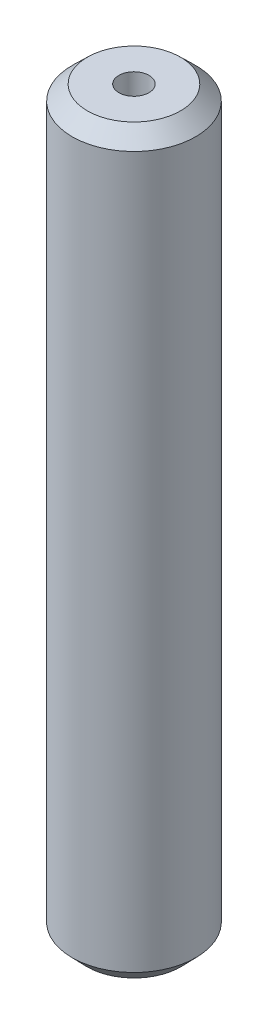
ISO-10303-21;
HEADER;
FILE_DESCRIPTION(('STEP AP214'),'2;1');
FILE_NAME('part.step','',(''),(''),'','','');
FILE_SCHEMA(('AUTOMOTIVE_DESIGN { 1 0 10303 214 1 1 1 1 }'));
ENDSEC;
DATA;
#1=APPLICATION_CONTEXT('core data for automotive mechanical design processes');
#2=APPLICATION_PROTOCOL_DEFINITION('international standard','automotive_design',2000,#1);
#3=PRODUCT_CONTEXT('',#1,'mechanical');
#4=PRODUCT('Part','Part','',(#3));
#5=PRODUCT_RELATED_PRODUCT_CATEGORY('part','',(#4));
#6=PRODUCT_DEFINITION_FORMATION('','',#4);
#7=PRODUCT_DEFINITION_CONTEXT('part definition',#1,'design');
#8=PRODUCT_DEFINITION('design','',#6,#7);
#9=PRODUCT_DEFINITION_SHAPE('','',#8);
#10=(LENGTH_UNIT() NAMED_UNIT(*) SI_UNIT(.MILLI.,.METRE.));
#11=(NAMED_UNIT(*) PLANE_ANGLE_UNIT() SI_UNIT($,.RADIAN.));
#12=(NAMED_UNIT(*) SI_UNIT($,.STERADIAN.) SOLID_ANGLE_UNIT());
#13=UNCERTAINTY_MEASURE_WITH_UNIT(LENGTH_MEASURE(1.E-05),#10,'distance_accuracy_value','');
#14=(GEOMETRIC_REPRESENTATION_CONTEXT(3) GLOBAL_UNCERTAINTY_ASSIGNED_CONTEXT((#13)) GLOBAL_UNIT_ASSIGNED_CONTEXT((#10,
#11,#12)) REPRESENTATION_CONTEXT('',''));
#15=CARTESIAN_POINT('',(0.,0.,0.));
#16=DIRECTION('',(0.,0.,1.));
#17=DIRECTION('',(1.,0.,0.));
#18=AXIS2_PLACEMENT_3D('',#15,#16,#17);
#19=CARTESIAN_POINT('',(0.,59.9678260889481,0.));
#20=DIRECTION('',(0.,-1.,0.));
#21=DIRECTION('',(0.,0.,-1.));
#22=AXIS2_PLACEMENT_3D('',#19,#20,#21);
#23=CYLINDRICAL_SURFACE('',#22,5.);
#24=CARTESIAN_POINT('',(0.,58.7722643186485,0.));
#25=DIRECTION('',(0.,1.,0.));
#26=DIRECTION('',(0.,0.,1.));
#27=AXIS2_PLACEMENT_3D('',#24,#25,#26);
#28=CIRCLE('',#27,5.);
#29=CARTESIAN_POINT('',(0.,58.7722643186485,5.));
#30=VERTEX_POINT('',#29);
#31=EDGE_CURVE('E50',#30,#30,#28,.F.);
#32=ORIENTED_EDGE('',*,*,#31,.T.);
#33=EDGE_LOOP('',(#32));
#34=FACE_BOUND('',#33,.T.);
#35=CARTESIAN_POINT('',(0.,1.23158666067393,0.));
#36=DIRECTION('',(0.,1.,0.));
#37=DIRECTION('',(0.,0.,1.));
#38=AXIS2_PLACEMENT_3D('',#35,#36,#37);
#39=CIRCLE('',#38,5.);
#40=CARTESIAN_POINT('',(0.,1.23158666067393,5.));
#41=VERTEX_POINT('',#40);
#42=EDGE_CURVE('E51',#41,#41,#39,.T.);
#43=ORIENTED_EDGE('',*,*,#42,.T.);
#44=EDGE_LOOP('',(#43));
#45=FACE_BOUND('',#44,.T.);
#46=ADVANCED_FACE('F39',(#34,#45),#23,.T.);
#47=CARTESIAN_POINT('',(0.,59.9678260889481,0.));
#48=DIRECTION('',(0.,1.,0.));
#49=DIRECTION('',(0.,0.,1.));
#50=AXIS2_PLACEMENT_3D('',#47,#48,#49);
#51=PLANE('',#50);
#52=CARTESIAN_POINT('',(0.,59.9678260889481,0.));
#53=DIRECTION('',(0.,1.,0.));
#54=DIRECTION('',(0.,0.,1.));
#55=AXIS2_PLACEMENT_3D('',#52,#53,#54);
#56=CIRCLE('',#55,3.76841333932609);
#57=CARTESIAN_POINT('',(0.,59.9678260889481,3.76841333932609));
#58=VERTEX_POINT('',#57);
#59=EDGE_CURVE('E54',#58,#58,#56,.T.);
#60=ORIENTED_EDGE('',*,*,#59,.T.);
#61=EDGE_LOOP('',(#60));
#62=FACE_BOUND('',#61,.T.);
#63=CARTESIAN_POINT('',(0.,59.9678260889481,0.));
#64=DIRECTION('',(0.,1.,0.));
#65=DIRECTION('',(0.,0.,1.));
#66=AXIS2_PLACEMENT_3D('',#63,#64,#65);
#67=CIRCLE('',#66,1.2178930979873);
#68=CARTESIAN_POINT('',(0.,59.9678260889481,1.2178930979873));
#69=VERTEX_POINT('',#68);
#70=EDGE_CURVE('E58',#69,#69,#67,.T.);
#71=ORIENTED_EDGE('',*,*,#70,.F.);
#72=EDGE_LOOP('',(#71));
#73=FACE_BOUND('',#72,.T.);
#74=ADVANCED_FACE('F69',(#62,#73),#51,.T.);
#75=CARTESIAN_POINT('',(0.,0.,0.));
#76=DIRECTION('',(0.,1.,0.));
#77=DIRECTION('',(0.,0.,1.));
#78=AXIS2_PLACEMENT_3D('',#75,#76,#77);
#79=PLANE('',#78);
#80=CARTESIAN_POINT('',(0.,0.,0.));
#81=DIRECTION('',(0.,1.,0.));
#82=DIRECTION('',(0.,0.,1.));
#83=AXIS2_PLACEMENT_3D('',#80,#81,#82);
#84=CIRCLE('',#83,3.80443822970038);
#85=CARTESIAN_POINT('',(0.,0.,3.80443822970038));
#86=VERTEX_POINT('',#85);
#87=EDGE_CURVE('E10',#86,#86,#84,.F.);
#88=ORIENTED_EDGE('',*,*,#87,.T.);
#89=EDGE_LOOP('',(#88));
#90=FACE_BOUND('',#89,.T.);
#91=CARTESIAN_POINT('',(0.,0.,0.));
#92=DIRECTION('',(0.,1.,0.));
#93=DIRECTION('',(0.,0.,1.));
#94=AXIS2_PLACEMENT_3D('',#91,#92,#93);
#95=CIRCLE('',#94,1.2178930979873);
#96=CARTESIAN_POINT('',(0.,0.,1.2178930979873));
#97=VERTEX_POINT('',#96);
#98=EDGE_CURVE('E63',#97,#97,#95,.T.);
#99=ORIENTED_EDGE('',*,*,#98,.T.);
#100=EDGE_LOOP('',(#99));
#101=FACE_BOUND('',#100,.T.);
#102=ADVANCED_FACE('F75',(#90,#101),#79,.F.);
#103=CARTESIAN_POINT('',(0.,59.9678260889481,0.));
#104=DIRECTION('',(0.,-1.,0.));
#105=DIRECTION('',(0.,0.,-1.));
#106=AXIS2_PLACEMENT_3D('',#103,#104,#105);
#107=CYLINDRICAL_SURFACE('',#106,1.2178930979873);
#108=ORIENTED_EDGE('',*,*,#70,.T.);
#109=EDGE_LOOP('',(#108));
#110=FACE_BOUND('',#109,.T.);
#111=ORIENTED_EDGE('',*,*,#98,.F.);
#112=EDGE_LOOP('',(#111));
#113=FACE_BOUND('',#112,.T.);
#114=ADVANCED_FACE('F70',(#110,#113),#107,.F.);
#115=CARTESIAN_POINT('',(0.,59.9678260889481,0.));
#116=DIRECTION('',(0.,-1.,0.));
#117=DIRECTION('',(0.,0.,-1.));
#118=AXIS2_PLACEMENT_3D('',#115,#116,#117);
#119=CONICAL_SURFACE('',#118,3.76841333932609,0.800239548805787);
#120=ORIENTED_EDGE('',*,*,#31,.F.);
#121=EDGE_LOOP('',(#120));
#122=FACE_BOUND('',#121,.T.);
#123=ORIENTED_EDGE('',*,*,#59,.F.);
#124=EDGE_LOOP('',(#123));
#125=FACE_BOUND('',#124,.T.);
#126=ADVANCED_FACE('F81',(#122,#125),#119,.T.);
#127=CARTESIAN_POINT('',(0.,1.23158666067393,0.));
#128=DIRECTION('',(0.,1.,0.));
#129=DIRECTION('',(0.,0.,1.));
#130=AXIS2_PLACEMENT_3D('',#127,#128,#129);
#131=CONICAL_SURFACE('',#130,5.,0.770556777989112);
#132=ORIENTED_EDGE('',*,*,#87,.F.);
#133=EDGE_LOOP('',(#132));
#134=FACE_BOUND('',#133,.T.);
#135=ORIENTED_EDGE('',*,*,#42,.F.);
#136=EDGE_LOOP('',(#135));
#137=FACE_BOUND('',#136,.T.);
#138=ADVANCED_FACE('F45',(#134,#137),#131,.T.);
#139=CLOSED_SHELL('',(#46,#74,#102,#114,#126,#138));
#140=MANIFOLD_SOLID_BREP('B2',#139);
#141=ADVANCED_BREP_SHAPE_REPRESENTATION('',(#18,#140),#14);
#142=SHAPE_DEFINITION_REPRESENTATION(#9,#141);
ENDSEC;
END-ISO-10303-21;
